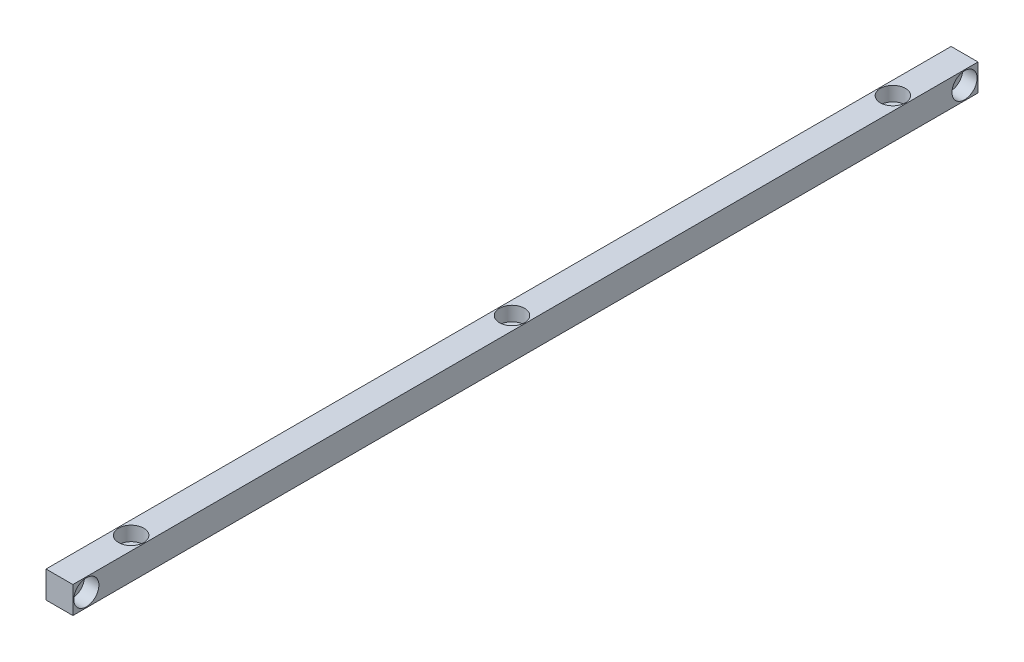
ISO-10303-21;
HEADER;
FILE_DESCRIPTION(('STEP AP214'),'2;1');
FILE_NAME('part.step','',(''),(''),'','','');
FILE_SCHEMA(('AUTOMOTIVE_DESIGN { 1 0 10303 214 1 1 1 1 }'));
ENDSEC;
DATA;
#1=APPLICATION_CONTEXT('core data for automotive mechanical design processes');
#2=APPLICATION_PROTOCOL_DEFINITION('international standard','automotive_design',2000,#1);
#3=PRODUCT_CONTEXT('',#1,'mechanical');
#4=PRODUCT('Part','Part','',(#3));
#5=PRODUCT_RELATED_PRODUCT_CATEGORY('part','',(#4));
#6=PRODUCT_DEFINITION_FORMATION('','',#4);
#7=PRODUCT_DEFINITION_CONTEXT('part definition',#1,'design');
#8=PRODUCT_DEFINITION('design','',#6,#7);
#9=PRODUCT_DEFINITION_SHAPE('','',#8);
#10=(LENGTH_UNIT() NAMED_UNIT(*) SI_UNIT(.MILLI.,.METRE.));
#11=(NAMED_UNIT(*) PLANE_ANGLE_UNIT() SI_UNIT($,.RADIAN.));
#12=(NAMED_UNIT(*) SI_UNIT($,.STERADIAN.) SOLID_ANGLE_UNIT());
#13=UNCERTAINTY_MEASURE_WITH_UNIT(LENGTH_MEASURE(1.E-05),#10,'distance_accuracy_value','');
#14=(GEOMETRIC_REPRESENTATION_CONTEXT(3) GLOBAL_UNCERTAINTY_ASSIGNED_CONTEXT((#13)) GLOBAL_UNIT_ASSIGNED_CONTEXT((#10,
#11,#12)) REPRESENTATION_CONTEXT('',''));
#15=CARTESIAN_POINT('',(0.,0.,0.));
#16=DIRECTION('',(0.,0.,1.));
#17=DIRECTION('',(1.,0.,0.));
#18=AXIS2_PLACEMENT_3D('',#15,#16,#17);
#19=CARTESIAN_POINT('',(0.,7.5,-212.5));
#20=DIRECTION('',(0.,1.,0.));
#21=DIRECTION('',(0.,0.,1.));
#22=AXIS2_PLACEMENT_3D('',#19,#20,#21);
#23=CYLINDRICAL_SURFACE('',#22,7.00000000000001);
#24=CARTESIAN_POINT('',(0.,-0.500000000000003,-212.5));
#25=DIRECTION('',(0.,1.,0.));
#26=DIRECTION('',(0.,0.,1.));
#27=AXIS2_PLACEMENT_3D('',#24,#25,#26);
#28=CIRCLE('',#27,7.00000000000001);
#29=CARTESIAN_POINT('',(0.,-0.500000000000003,-205.5));
#30=VERTEX_POINT('',#29);
#31=EDGE_CURVE('E11',#30,#30,#28,.T.);
#32=ORIENTED_EDGE('',*,*,#31,.F.);
#33=EDGE_LOOP('',(#32));
#34=FACE_BOUND('',#33,.T.);
#35=CARTESIAN_POINT('',(0.,7.5,-212.5));
#36=DIRECTION('',(0.,1.,0.));
#37=DIRECTION('',(0.,0.,1.));
#38=AXIS2_PLACEMENT_3D('',#35,#36,#37);
#39=CIRCLE('',#38,7.00000000000001);
#40=CARTESIAN_POINT('',(0.,7.5,-205.5));
#41=VERTEX_POINT('',#40);
#42=EDGE_CURVE('E112',#41,#41,#39,.T.);
#43=ORIENTED_EDGE('',*,*,#42,.T.);
#44=EDGE_LOOP('',(#43));
#45=FACE_BOUND('',#44,.T.);
#46=ADVANCED_FACE('F34',(#34,#45),#23,.F.);
#47=CARTESIAN_POINT('',(4.25000000000001,-0.500000000000003,-212.5));
#48=DIRECTION('',(0.,-1.,0.));
#49=DIRECTION('',(0.,0.,-1.));
#50=AXIS2_PLACEMENT_3D('',#47,#48,#49);
#51=PLANE('',#50);
#52=CARTESIAN_POINT('',(0.,-0.500000000000003,-212.5));
#53=DIRECTION('',(0.,1.,0.));
#54=DIRECTION('',(0.,0.,1.));
#55=AXIS2_PLACEMENT_3D('',#52,#53,#54);
#56=CIRCLE('',#55,4.25000000000001);
#57=CARTESIAN_POINT('',(0.,-0.500000000000003,-208.25));
#58=VERTEX_POINT('',#57);
#59=EDGE_CURVE('E42',#58,#58,#56,.T.);
#60=ORIENTED_EDGE('',*,*,#59,.F.);
#61=EDGE_LOOP('',(#60));
#62=FACE_BOUND('',#61,.T.);
#63=ORIENTED_EDGE('',*,*,#31,.T.);
#64=EDGE_LOOP('',(#63));
#65=FACE_BOUND('',#64,.T.);
#66=ADVANCED_FACE('F122',(#62,#65),#51,.F.);
#67=CARTESIAN_POINT('',(0.,7.5,-212.5));
#68=DIRECTION('',(0.,1.,0.));
#69=DIRECTION('',(0.,0.,1.));
#70=AXIS2_PLACEMENT_3D('',#67,#68,#69);
#71=CYLINDRICAL_SURFACE('',#70,4.25000000000001);
#72=CARTESIAN_POINT('',(0.,-7.5,-212.5));
#73=DIRECTION('',(0.,1.,0.));
#74=DIRECTION('',(0.,0.,1.));
#75=AXIS2_PLACEMENT_3D('',#72,#73,#74);
#76=CIRCLE('',#75,4.25000000000001);
#77=CARTESIAN_POINT('',(0.,-7.5,-208.25));
#78=VERTEX_POINT('',#77);
#79=EDGE_CURVE('E115',#78,#78,#76,.T.);
#80=ORIENTED_EDGE('',*,*,#79,.F.);
#81=EDGE_LOOP('',(#80));
#82=FACE_BOUND('',#81,.T.);
#83=ORIENTED_EDGE('',*,*,#59,.T.);
#84=EDGE_LOOP('',(#83));
#85=FACE_BOUND('',#84,.T.);
#86=ADVANCED_FACE('F120',(#82,#85),#71,.F.);
#87=CARTESIAN_POINT('',(7.5,7.5,252.5));
#88=DIRECTION('',(-1.,0.,0.));
#89=DIRECTION('',(0.,-1.,0.));
#90=AXIS2_PLACEMENT_3D('',#87,#88,#89);
#91=PLANE('',#90);
#92=CARTESIAN_POINT('',(7.5,0.,-245.));
#93=DIRECTION('',(1.,0.,0.));
#94=DIRECTION('',(0.,0.,-1.));
#95=AXIS2_PLACEMENT_3D('',#92,#93,#94);
#96=CIRCLE('',#95,7.00000000000001);
#97=CARTESIAN_POINT('',(7.5,0.,-252.));
#98=VERTEX_POINT('',#97);
#99=EDGE_CURVE('E253',#98,#98,#96,.T.);
#100=ORIENTED_EDGE('',*,*,#99,.F.);
#101=EDGE_LOOP('',(#100));
#102=FACE_BOUND('',#101,.T.);
#103=DIRECTION('',(0.,1.,0.));
#104=VECTOR('',#103,1.);
#105=CARTESIAN_POINT('',(7.5,7.5,-252.5));
#106=LINE('',#105,#104);
#107=CARTESIAN_POINT('',(7.5,-7.5,-252.5));
#108=VERTEX_POINT('',#107);
#109=CARTESIAN_POINT('',(7.5,7.5,-252.5));
#110=VERTEX_POINT('',#109);
#111=EDGE_CURVE('E102',#108,#110,#106,.T.);
#112=ORIENTED_EDGE('',*,*,#111,.T.);
#113=DIRECTION('',(0.,0.,-1.));
#114=VECTOR('',#113,1.);
#115=CARTESIAN_POINT('',(7.5,7.5,252.5));
#116=LINE('',#115,#114);
#117=CARTESIAN_POINT('',(7.5,7.5,252.5));
#118=VERTEX_POINT('',#117);
#119=EDGE_CURVE('E93',#118,#110,#116,.T.);
#120=ORIENTED_EDGE('',*,*,#119,.F.);
#121=DIRECTION('',(0.,1.,0.));
#122=VECTOR('',#121,1.);
#123=CARTESIAN_POINT('',(7.5,7.5,252.5));
#124=LINE('',#123,#122);
#125=CARTESIAN_POINT('',(7.5,-7.5,252.5));
#126=VERTEX_POINT('',#125);
#127=EDGE_CURVE('E86',#126,#118,#124,.T.);
#128=ORIENTED_EDGE('',*,*,#127,.F.);
#129=DIRECTION('',(0.,0.,-1.));
#130=VECTOR('',#129,1.);
#131=CARTESIAN_POINT('',(7.5,-7.5,252.5));
#132=LINE('',#131,#130);
#133=EDGE_CURVE('E98',#126,#108,#132,.T.);
#134=ORIENTED_EDGE('',*,*,#133,.T.);
#135=EDGE_LOOP('',(#112,#120,#128,#134));
#136=FACE_BOUND('',#135,.T.);
#137=CARTESIAN_POINT('',(7.5,0.,245.));
#138=DIRECTION('',(1.,0.,0.));
#139=DIRECTION('',(0.,0.,-1.));
#140=AXIS2_PLACEMENT_3D('',#137,#138,#139);
#141=CIRCLE('',#140,7.00000000000001);
#142=CARTESIAN_POINT('',(7.5,0.,238.));
#143=VERTEX_POINT('',#142);
#144=EDGE_CURVE('E241',#143,#143,#141,.T.);
#145=ORIENTED_EDGE('',*,*,#144,.F.);
#146=EDGE_LOOP('',(#145));
#147=FACE_BOUND('',#146,.T.);
#148=ADVANCED_FACE('F131',(#102,#136,#147),#91,.F.);
#149=CARTESIAN_POINT('',(-7.5,7.5,252.5));
#150=DIRECTION('',(0.,-1.,0.));
#151=DIRECTION('',(0.,0.,-1.));
#152=AXIS2_PLACEMENT_3D('',#149,#150,#151);
#153=PLANE('',#152);
#154=CARTESIAN_POINT('',(0.,7.5,0.));
#155=DIRECTION('',(0.,1.,0.));
#156=DIRECTION('',(0.,0.,1.));
#157=AXIS2_PLACEMENT_3D('',#154,#155,#156);
#158=CIRCLE('',#157,7.00000000000001);
#159=CARTESIAN_POINT('',(0.,7.5,7.00000000000004));
#160=VERTEX_POINT('',#159);
#161=EDGE_CURVE('E220',#160,#160,#158,.T.);
#162=ORIENTED_EDGE('',*,*,#161,.F.);
#163=EDGE_LOOP('',(#162));
#164=FACE_BOUND('',#163,.T.);
#165=CARTESIAN_POINT('',(0.,7.5,212.5));
#166=DIRECTION('',(0.,1.,0.));
#167=DIRECTION('',(0.,0.,1.));
#168=AXIS2_PLACEMENT_3D('',#165,#166,#167);
#169=CIRCLE('',#168,7.00000000000001);
#170=CARTESIAN_POINT('',(0.,7.5,219.5));
#171=VERTEX_POINT('',#170);
#172=EDGE_CURVE('E229',#171,#171,#169,.T.);
#173=ORIENTED_EDGE('',*,*,#172,.F.);
#174=EDGE_LOOP('',(#173));
#175=FACE_BOUND('',#174,.T.);
#176=DIRECTION('',(-1.,0.,0.));
#177=VECTOR('',#176,1.);
#178=CARTESIAN_POINT('',(-7.5,7.5,-252.5));
#179=LINE('',#178,#177);
#180=CARTESIAN_POINT('',(-7.5,7.5,-252.5));
#181=VERTEX_POINT('',#180);
#182=EDGE_CURVE('E92',#110,#181,#179,.T.);
#183=ORIENTED_EDGE('',*,*,#182,.T.);
#184=DIRECTION('',(0.,0.,-1.));
#185=VECTOR('',#184,1.);
#186=CARTESIAN_POINT('',(-7.5,7.5,252.5));
#187=LINE('',#186,#185);
#188=CARTESIAN_POINT('',(-7.5,7.5,252.5));
#189=VERTEX_POINT('',#188);
#190=EDGE_CURVE('E89',#189,#181,#187,.T.);
#191=ORIENTED_EDGE('',*,*,#190,.F.);
#192=DIRECTION('',(-1.,0.,0.));
#193=VECTOR('',#192,1.);
#194=CARTESIAN_POINT('',(-7.5,7.5,252.5));
#195=LINE('',#194,#193);
#196=EDGE_CURVE('E81',#118,#189,#195,.T.);
#197=ORIENTED_EDGE('',*,*,#196,.F.);
#198=ORIENTED_EDGE('',*,*,#119,.T.);
#199=EDGE_LOOP('',(#183,#191,#197,#198));
#200=FACE_BOUND('',#199,.T.);
#201=ORIENTED_EDGE('',*,*,#42,.F.);
#202=EDGE_LOOP('',(#201));
#203=FACE_BOUND('',#202,.T.);
#204=ADVANCED_FACE('F90',(#164,#175,#200,#203),#153,.F.);
#205=CARTESIAN_POINT('',(-7.5,7.5,252.5));
#206=DIRECTION('',(1.,0.,0.));
#207=DIRECTION('',(0.,1.,0.));
#208=AXIS2_PLACEMENT_3D('',#205,#206,#207);
#209=PLANE('',#208);
#210=CARTESIAN_POINT('',(-7.5,0.,245.));
#211=DIRECTION('',(1.,0.,0.));
#212=DIRECTION('',(0.,0.,-1.));
#213=AXIS2_PLACEMENT_3D('',#210,#211,#212);
#214=CIRCLE('',#213,4.25000000000001);
#215=CARTESIAN_POINT('',(-7.5,0.,240.75));
#216=VERTEX_POINT('',#215);
#217=EDGE_CURVE('E250',#216,#216,#214,.T.);
#218=ORIENTED_EDGE('',*,*,#217,.T.);
#219=EDGE_LOOP('',(#218));
#220=FACE_BOUND('',#219,.T.);
#221=CARTESIAN_POINT('',(-7.5,0.,-245.));
#222=DIRECTION('',(1.,0.,0.));
#223=DIRECTION('',(0.,0.,-1.));
#224=AXIS2_PLACEMENT_3D('',#221,#222,#223);
#225=CIRCLE('',#224,4.25000000000001);
#226=CARTESIAN_POINT('',(-7.5,0.,-249.25));
#227=VERTEX_POINT('',#226);
#228=EDGE_CURVE('E105',#227,#227,#225,.T.);
#229=ORIENTED_EDGE('',*,*,#228,.T.);
#230=EDGE_LOOP('',(#229));
#231=FACE_BOUND('',#230,.T.);
#232=DIRECTION('',(0.,-1.,0.));
#233=VECTOR('',#232,1.);
#234=CARTESIAN_POINT('',(-7.5,7.5,-252.5));
#235=LINE('',#234,#233);
#236=CARTESIAN_POINT('',(-7.5,-7.5,-252.5));
#237=VERTEX_POINT('',#236);
#238=EDGE_CURVE('E67',#181,#237,#235,.T.);
#239=ORIENTED_EDGE('',*,*,#238,.T.);
#240=DIRECTION('',(0.,0.,-1.));
#241=VECTOR('',#240,1.);
#242=CARTESIAN_POINT('',(-7.5,-7.5,252.5));
#243=LINE('',#242,#241);
#244=CARTESIAN_POINT('',(-7.5,-7.5,252.5));
#245=VERTEX_POINT('',#244);
#246=EDGE_CURVE('E94',#245,#237,#243,.T.);
#247=ORIENTED_EDGE('',*,*,#246,.F.);
#248=DIRECTION('',(0.,-1.,0.));
#249=VECTOR('',#248,1.);
#250=CARTESIAN_POINT('',(-7.5,7.5,252.5));
#251=LINE('',#250,#249);
#252=EDGE_CURVE('E84',#189,#245,#251,.T.);
#253=ORIENTED_EDGE('',*,*,#252,.F.);
#254=ORIENTED_EDGE('',*,*,#190,.T.);
#255=EDGE_LOOP('',(#239,#247,#253,#254));
#256=FACE_BOUND('',#255,.T.);
#257=ADVANCED_FACE('F96',(#220,#231,#256),#209,.F.);
#258=CARTESIAN_POINT('',(-7.5,-7.5,252.5));
#259=DIRECTION('',(0.,1.,0.));
#260=DIRECTION('',(0.,0.,1.));
#261=AXIS2_PLACEMENT_3D('',#258,#259,#260);
#262=PLANE('',#261);
#263=CARTESIAN_POINT('',(0.,-7.5,0.));
#264=DIRECTION('',(0.,1.,0.));
#265=DIRECTION('',(0.,0.,1.));
#266=AXIS2_PLACEMENT_3D('',#263,#264,#265);
#267=CIRCLE('',#266,4.25000000000001);
#268=CARTESIAN_POINT('',(0.,-7.5,4.25000000000004));
#269=VERTEX_POINT('',#268);
#270=EDGE_CURVE('E221',#269,#269,#267,.T.);
#271=ORIENTED_EDGE('',*,*,#270,.T.);
#272=EDGE_LOOP('',(#271));
#273=FACE_BOUND('',#272,.T.);
#274=CARTESIAN_POINT('',(0.,-7.5,212.5));
#275=DIRECTION('',(0.,1.,0.));
#276=DIRECTION('',(0.,0.,1.));
#277=AXIS2_PLACEMENT_3D('',#274,#275,#276);
#278=CIRCLE('',#277,4.25000000000001);
#279=CARTESIAN_POINT('',(0.,-7.5,216.75));
#280=VERTEX_POINT('',#279);
#281=EDGE_CURVE('E238',#280,#280,#278,.T.);
#282=ORIENTED_EDGE('',*,*,#281,.T.);
#283=EDGE_LOOP('',(#282));
#284=FACE_BOUND('',#283,.T.);
#285=DIRECTION('',(1.,0.,0.));
#286=VECTOR('',#285,1.);
#287=CARTESIAN_POINT('',(-7.5,-7.5,-252.5));
#288=LINE('',#287,#286);
#289=EDGE_CURVE('E73',#237,#108,#288,.T.);
#290=ORIENTED_EDGE('',*,*,#289,.T.);
#291=ORIENTED_EDGE('',*,*,#133,.F.);
#292=DIRECTION('',(1.,0.,0.));
#293=VECTOR('',#292,1.);
#294=CARTESIAN_POINT('',(-7.5,-7.5,252.5));
#295=LINE('',#294,#293);
#296=EDGE_CURVE('E50',#245,#126,#295,.T.);
#297=ORIENTED_EDGE('',*,*,#296,.F.);
#298=ORIENTED_EDGE('',*,*,#246,.T.);
#299=EDGE_LOOP('',(#290,#291,#297,#298));
#300=FACE_BOUND('',#299,.T.);
#301=ORIENTED_EDGE('',*,*,#79,.T.);
#302=EDGE_LOOP('',(#301));
#303=FACE_BOUND('',#302,.T.);
#304=ADVANCED_FACE('F138',(#273,#284,#300,#303),#262,.F.);
#305=CARTESIAN_POINT('',(0.,0.,252.5));
#306=DIRECTION('',(0.,0.,1.));
#307=DIRECTION('',(1.,0.,0.));
#308=AXIS2_PLACEMENT_3D('',#305,#306,#307);
#309=PLANE('',#308);
#310=ORIENTED_EDGE('',*,*,#127,.T.);
#311=ORIENTED_EDGE('',*,*,#196,.T.);
#312=ORIENTED_EDGE('',*,*,#252,.T.);
#313=ORIENTED_EDGE('',*,*,#296,.T.);
#314=EDGE_LOOP('',(#310,#311,#312,#313));
#315=FACE_BOUND('',#314,.T.);
#316=ADVANCED_FACE('F82',(#315),#309,.T.);
#317=CARTESIAN_POINT('',(0.,0.,-252.5));
#318=DIRECTION('',(0.,0.,1.));
#319=DIRECTION('',(1.,0.,0.));
#320=AXIS2_PLACEMENT_3D('',#317,#318,#319);
#321=PLANE('',#320);
#322=ORIENTED_EDGE('',*,*,#111,.F.);
#323=ORIENTED_EDGE('',*,*,#289,.F.);
#324=ORIENTED_EDGE('',*,*,#238,.F.);
#325=ORIENTED_EDGE('',*,*,#182,.F.);
#326=EDGE_LOOP('',(#322,#323,#324,#325));
#327=FACE_BOUND('',#326,.T.);
#328=ADVANCED_FACE('F158',(#327),#321,.F.);
#329=CARTESIAN_POINT('',(7.5,0.,-245.));
#330=DIRECTION('',(1.,0.,0.));
#331=DIRECTION('',(0.,0.,-1.));
#332=AXIS2_PLACEMENT_3D('',#329,#330,#331);
#333=CYLINDRICAL_SURFACE('',#332,4.25000000000001);
#334=ORIENTED_EDGE('',*,*,#228,.F.);
#335=EDGE_LOOP('',(#334));
#336=FACE_BOUND('',#335,.T.);
#337=CARTESIAN_POINT('',(-0.499999999999999,0.,-245.));
#338=DIRECTION('',(1.,0.,0.));
#339=DIRECTION('',(0.,0.,-1.));
#340=AXIS2_PLACEMENT_3D('',#337,#338,#339);
#341=CIRCLE('',#340,4.25000000000001);
#342=CARTESIAN_POINT('',(-0.499999999999999,0.,-249.25));
#343=VERTEX_POINT('',#342);
#344=EDGE_CURVE('E259',#343,#343,#341,.T.);
#345=ORIENTED_EDGE('',*,*,#344,.T.);
#346=EDGE_LOOP('',(#345));
#347=FACE_BOUND('',#346,.T.);
#348=ADVANCED_FACE('F164',(#336,#347),#333,.F.);
#349=CARTESIAN_POINT('',(-0.499999999999999,4.25000000000001,-245.));
#350=DIRECTION('',(-1.,0.,0.));
#351=DIRECTION('',(0.,0.,1.));
#352=AXIS2_PLACEMENT_3D('',#349,#350,#351);
#353=PLANE('',#352);
#354=ORIENTED_EDGE('',*,*,#344,.F.);
#355=EDGE_LOOP('',(#354));
#356=FACE_BOUND('',#355,.T.);
#357=CARTESIAN_POINT('',(-0.499999999999999,0.,-245.));
#358=DIRECTION('',(1.,0.,0.));
#359=DIRECTION('',(0.,0.,-1.));
#360=AXIS2_PLACEMENT_3D('',#357,#358,#359);
#361=CIRCLE('',#360,7.00000000000001);
#362=CARTESIAN_POINT('',(-0.499999999999999,0.,-252.));
#363=VERTEX_POINT('',#362);
#364=EDGE_CURVE('E256',#363,#363,#361,.T.);
#365=ORIENTED_EDGE('',*,*,#364,.T.);
#366=EDGE_LOOP('',(#365));
#367=FACE_BOUND('',#366,.T.);
#368=ADVANCED_FACE('F169',(#356,#367),#353,.F.);
#369=CARTESIAN_POINT('',(7.5,0.,-245.));
#370=DIRECTION('',(1.,0.,0.));
#371=DIRECTION('',(0.,0.,-1.));
#372=AXIS2_PLACEMENT_3D('',#369,#370,#371);
#373=CYLINDRICAL_SURFACE('',#372,7.00000000000001);
#374=ORIENTED_EDGE('',*,*,#364,.F.);
#375=EDGE_LOOP('',(#374));
#376=FACE_BOUND('',#375,.T.);
#377=ORIENTED_EDGE('',*,*,#99,.T.);
#378=EDGE_LOOP('',(#377));
#379=FACE_BOUND('',#378,.T.);
#380=ADVANCED_FACE('F173',(#376,#379),#373,.F.);
#381=CARTESIAN_POINT('',(7.5,0.,245.));
#382=DIRECTION('',(1.,0.,0.));
#383=DIRECTION('',(0.,0.,-1.));
#384=AXIS2_PLACEMENT_3D('',#381,#382,#383);
#385=CYLINDRICAL_SURFACE('',#384,4.25000000000001);
#386=ORIENTED_EDGE('',*,*,#217,.F.);
#387=EDGE_LOOP('',(#386));
#388=FACE_BOUND('',#387,.T.);
#389=CARTESIAN_POINT('',(-0.499999999999999,0.,245.));
#390=DIRECTION('',(1.,0.,0.));
#391=DIRECTION('',(0.,0.,-1.));
#392=AXIS2_PLACEMENT_3D('',#389,#390,#391);
#393=CIRCLE('',#392,4.25000000000001);
#394=CARTESIAN_POINT('',(-0.499999999999999,0.,240.75));
#395=VERTEX_POINT('',#394);
#396=EDGE_CURVE('E247',#395,#395,#393,.T.);
#397=ORIENTED_EDGE('',*,*,#396,.T.);
#398=EDGE_LOOP('',(#397));
#399=FACE_BOUND('',#398,.T.);
#400=ADVANCED_FACE('F177',(#388,#399),#385,.F.);
#401=CARTESIAN_POINT('',(-0.499999999999999,4.25000000000001,245.));
#402=DIRECTION('',(-1.,0.,0.));
#403=DIRECTION('',(0.,0.,1.));
#404=AXIS2_PLACEMENT_3D('',#401,#402,#403);
#405=PLANE('',#404);
#406=ORIENTED_EDGE('',*,*,#396,.F.);
#407=EDGE_LOOP('',(#406));
#408=FACE_BOUND('',#407,.T.);
#409=CARTESIAN_POINT('',(-0.499999999999999,0.,245.));
#410=DIRECTION('',(1.,0.,0.));
#411=DIRECTION('',(0.,0.,-1.));
#412=AXIS2_PLACEMENT_3D('',#409,#410,#411);
#413=CIRCLE('',#412,7.00000000000001);
#414=CARTESIAN_POINT('',(-0.499999999999999,0.,238.));
#415=VERTEX_POINT('',#414);
#416=EDGE_CURVE('E244',#415,#415,#413,.T.);
#417=ORIENTED_EDGE('',*,*,#416,.T.);
#418=EDGE_LOOP('',(#417));
#419=FACE_BOUND('',#418,.T.);
#420=ADVANCED_FACE('F181',(#408,#419),#405,.F.);
#421=CARTESIAN_POINT('',(7.5,0.,245.));
#422=DIRECTION('',(1.,0.,0.));
#423=DIRECTION('',(0.,0.,-1.));
#424=AXIS2_PLACEMENT_3D('',#421,#422,#423);
#425=CYLINDRICAL_SURFACE('',#424,7.00000000000001);
#426=ORIENTED_EDGE('',*,*,#416,.F.);
#427=EDGE_LOOP('',(#426));
#428=FACE_BOUND('',#427,.T.);
#429=ORIENTED_EDGE('',*,*,#144,.T.);
#430=EDGE_LOOP('',(#429));
#431=FACE_BOUND('',#430,.T.);
#432=ADVANCED_FACE('F185',(#428,#431),#425,.F.);
#433=CARTESIAN_POINT('',(0.,7.5,212.5));
#434=DIRECTION('',(0.,1.,0.));
#435=DIRECTION('',(0.,0.,1.));
#436=AXIS2_PLACEMENT_3D('',#433,#434,#435);
#437=CYLINDRICAL_SURFACE('',#436,4.25000000000001);
#438=ORIENTED_EDGE('',*,*,#281,.F.);
#439=EDGE_LOOP('',(#438));
#440=FACE_BOUND('',#439,.T.);
#441=CARTESIAN_POINT('',(0.,-0.500000000000003,212.5));
#442=DIRECTION('',(0.,1.,0.));
#443=DIRECTION('',(0.,0.,1.));
#444=AXIS2_PLACEMENT_3D('',#441,#442,#443);
#445=CIRCLE('',#444,4.25000000000001);
#446=CARTESIAN_POINT('',(0.,-0.500000000000003,216.75));
#447=VERTEX_POINT('',#446);
#448=EDGE_CURVE('E235',#447,#447,#445,.T.);
#449=ORIENTED_EDGE('',*,*,#448,.T.);
#450=EDGE_LOOP('',(#449));
#451=FACE_BOUND('',#450,.T.);
#452=ADVANCED_FACE('F189',(#440,#451),#437,.F.);
#453=CARTESIAN_POINT('',(4.25000000000001,-0.500000000000003,212.5));
#454=DIRECTION('',(0.,-1.,0.));
#455=DIRECTION('',(0.,0.,-1.));
#456=AXIS2_PLACEMENT_3D('',#453,#454,#455);
#457=PLANE('',#456);
#458=ORIENTED_EDGE('',*,*,#448,.F.);
#459=EDGE_LOOP('',(#458));
#460=FACE_BOUND('',#459,.T.);
#461=CARTESIAN_POINT('',(0.,-0.500000000000003,212.5));
#462=DIRECTION('',(0.,1.,0.));
#463=DIRECTION('',(0.,0.,1.));
#464=AXIS2_PLACEMENT_3D('',#461,#462,#463);
#465=CIRCLE('',#464,7.00000000000001);
#466=CARTESIAN_POINT('',(0.,-0.500000000000003,219.5));
#467=VERTEX_POINT('',#466);
#468=EDGE_CURVE('E232',#467,#467,#465,.T.);
#469=ORIENTED_EDGE('',*,*,#468,.T.);
#470=EDGE_LOOP('',(#469));
#471=FACE_BOUND('',#470,.T.);
#472=ADVANCED_FACE('F193',(#460,#471),#457,.F.);
#473=CARTESIAN_POINT('',(0.,7.5,212.5));
#474=DIRECTION('',(0.,1.,0.));
#475=DIRECTION('',(0.,0.,1.));
#476=AXIS2_PLACEMENT_3D('',#473,#474,#475);
#477=CYLINDRICAL_SURFACE('',#476,7.00000000000001);
#478=ORIENTED_EDGE('',*,*,#468,.F.);
#479=EDGE_LOOP('',(#478));
#480=FACE_BOUND('',#479,.T.);
#481=ORIENTED_EDGE('',*,*,#172,.T.);
#482=EDGE_LOOP('',(#481));
#483=FACE_BOUND('',#482,.T.);
#484=ADVANCED_FACE('F197',(#480,#483),#477,.F.);
#485=CARTESIAN_POINT('',(0.,7.5,0.));
#486=DIRECTION('',(0.,1.,0.));
#487=DIRECTION('',(0.,0.,1.));
#488=AXIS2_PLACEMENT_3D('',#485,#486,#487);
#489=CYLINDRICAL_SURFACE('',#488,4.25000000000001);
#490=ORIENTED_EDGE('',*,*,#270,.F.);
#491=EDGE_LOOP('',(#490));
#492=FACE_BOUND('',#491,.T.);
#493=CARTESIAN_POINT('',(0.,-0.500000000000003,0.));
#494=DIRECTION('',(0.,1.,0.));
#495=DIRECTION('',(0.,0.,1.));
#496=AXIS2_PLACEMENT_3D('',#493,#494,#495);
#497=CIRCLE('',#496,4.25000000000001);
#498=CARTESIAN_POINT('',(0.,-0.500000000000003,4.25000000000004));
#499=VERTEX_POINT('',#498);
#500=EDGE_CURVE('E226',#499,#499,#497,.T.);
#501=ORIENTED_EDGE('',*,*,#500,.T.);
#502=EDGE_LOOP('',(#501));
#503=FACE_BOUND('',#502,.T.);
#504=ADVANCED_FACE('F201',(#492,#503),#489,.F.);
#505=CARTESIAN_POINT('',(4.25000000000001,-0.500000000000003,0.));
#506=DIRECTION('',(0.,-1.,0.));
#507=DIRECTION('',(0.,0.,-1.));
#508=AXIS2_PLACEMENT_3D('',#505,#506,#507);
#509=PLANE('',#508);
#510=ORIENTED_EDGE('',*,*,#500,.F.);
#511=EDGE_LOOP('',(#510));
#512=FACE_BOUND('',#511,.T.);
#513=CARTESIAN_POINT('',(0.,-0.500000000000003,0.));
#514=DIRECTION('',(0.,1.,0.));
#515=DIRECTION('',(0.,0.,1.));
#516=AXIS2_PLACEMENT_3D('',#513,#514,#515);
#517=CIRCLE('',#516,7.00000000000001);
#518=CARTESIAN_POINT('',(0.,-0.500000000000003,7.00000000000004));
#519=VERTEX_POINT('',#518);
#520=EDGE_CURVE('E218',#519,#519,#517,.T.);
#521=ORIENTED_EDGE('',*,*,#520,.T.);
#522=EDGE_LOOP('',(#521));
#523=FACE_BOUND('',#522,.T.);
#524=ADVANCED_FACE('F205',(#512,#523),#509,.F.);
#525=CARTESIAN_POINT('',(0.,7.5,0.));
#526=DIRECTION('',(0.,1.,0.));
#527=DIRECTION('',(0.,0.,1.));
#528=AXIS2_PLACEMENT_3D('',#525,#526,#527);
#529=CYLINDRICAL_SURFACE('',#528,7.00000000000001);
#530=ORIENTED_EDGE('',*,*,#520,.F.);
#531=EDGE_LOOP('',(#530));
#532=FACE_BOUND('',#531,.T.);
#533=ORIENTED_EDGE('',*,*,#161,.T.);
#534=EDGE_LOOP('',(#533));
#535=FACE_BOUND('',#534,.T.);
#536=ADVANCED_FACE('F209',(#532,#535),#529,.F.);
#537=CLOSED_SHELL('',(#46,#66,#86,#148,#204,#257,#304,#316,#328,#348,#368,#380,#400,#420,#432,
#452,#472,#484,#504,#524,#536));
#538=MANIFOLD_SOLID_BREP('B2',#537);
#539=ADVANCED_BREP_SHAPE_REPRESENTATION('',(#18,#538),#14);
#540=SHAPE_DEFINITION_REPRESENTATION(#9,#539);
ENDSEC;
END-ISO-10303-21;
